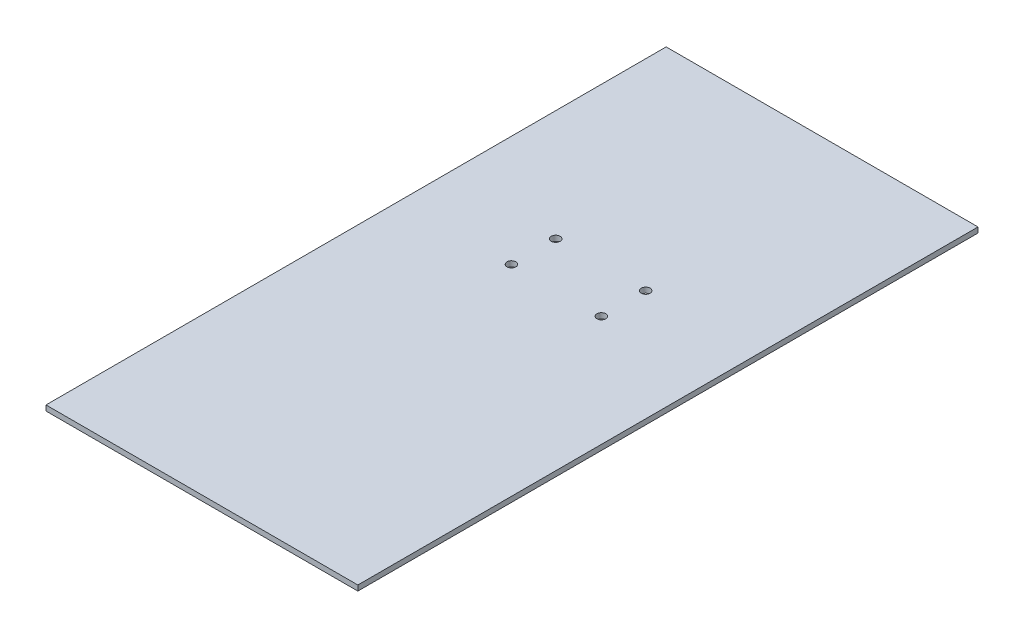
ISO-10303-21;
HEADER;
FILE_DESCRIPTION(('STEP AP214'),'2;1');
FILE_NAME('part.step','',(''),(''),'','','');
FILE_SCHEMA(('AUTOMOTIVE_DESIGN { 1 0 10303 214 1 1 1 1 }'));
ENDSEC;
DATA;
#1=APPLICATION_CONTEXT('core data for automotive mechanical design processes');
#2=APPLICATION_PROTOCOL_DEFINITION('international standard','automotive_design',2000,#1);
#3=PRODUCT_CONTEXT('',#1,'mechanical');
#4=PRODUCT('Part','Part','',(#3));
#5=PRODUCT_RELATED_PRODUCT_CATEGORY('part','',(#4));
#6=PRODUCT_DEFINITION_FORMATION('','',#4);
#7=PRODUCT_DEFINITION_CONTEXT('part definition',#1,'design');
#8=PRODUCT_DEFINITION('design','',#6,#7);
#9=PRODUCT_DEFINITION_SHAPE('','',#8);
#10=(LENGTH_UNIT() NAMED_UNIT(*) SI_UNIT(.MILLI.,.METRE.));
#11=(NAMED_UNIT(*) PLANE_ANGLE_UNIT() SI_UNIT($,.RADIAN.));
#12=(NAMED_UNIT(*) SI_UNIT($,.STERADIAN.) SOLID_ANGLE_UNIT());
#13=UNCERTAINTY_MEASURE_WITH_UNIT(LENGTH_MEASURE(1.E-05),#10,'distance_accuracy_value','');
#14=(GEOMETRIC_REPRESENTATION_CONTEXT(3) GLOBAL_UNCERTAINTY_ASSIGNED_CONTEXT((#13)) GLOBAL_UNIT_ASSIGNED_CONTEXT((#10,
#11,#12)) REPRESENTATION_CONTEXT('',''));
#15=CARTESIAN_POINT('',(0.,0.,0.));
#16=DIRECTION('',(0.,0.,1.));
#17=DIRECTION('',(1.,0.,0.));
#18=AXIS2_PLACEMENT_3D('',#15,#16,#17);
#19=CARTESIAN_POINT('',(0.,3.,0.));
#20=DIRECTION('',(1.,0.,0.));
#21=DIRECTION('',(0.,0.,-1.));
#22=AXIS2_PLACEMENT_3D('',#19,#20,#21);
#23=PLANE('',#22);
#24=DIRECTION('',(0.,0.,1.));
#25=VECTOR('',#24,1.);
#26=CARTESIAN_POINT('',(0.,0.,0.));
#27=LINE('',#26,#25);
#28=CARTESIAN_POINT('',(0.,0.,-350.));
#29=VERTEX_POINT('',#28);
#30=CARTESIAN_POINT('',(0.,0.,0.));
#31=VERTEX_POINT('',#30);
#32=EDGE_CURVE('E95',#29,#31,#27,.T.);
#33=ORIENTED_EDGE('',*,*,#32,.T.);
#34=DIRECTION('',(0.,-1.,0.));
#35=VECTOR('',#34,1.);
#36=CARTESIAN_POINT('',(0.,3.,0.));
#37=LINE('',#36,#35);
#38=CARTESIAN_POINT('',(0.,3.,0.));
#39=VERTEX_POINT('',#38);
#40=EDGE_CURVE('E11',#39,#31,#37,.T.);
#41=ORIENTED_EDGE('',*,*,#40,.F.);
#42=DIRECTION('',(0.,0.,1.));
#43=VECTOR('',#42,1.);
#44=CARTESIAN_POINT('',(0.,3.,0.));
#45=LINE('',#44,#43);
#46=CARTESIAN_POINT('',(0.,3.,-350.));
#47=VERTEX_POINT('',#46);
#48=EDGE_CURVE('E83',#47,#39,#45,.T.);
#49=ORIENTED_EDGE('',*,*,#48,.F.);
#50=DIRECTION('',(0.,-1.,0.));
#51=VECTOR('',#50,1.);
#52=CARTESIAN_POINT('',(0.,3.,-350.));
#53=LINE('',#52,#51);
#54=EDGE_CURVE('E91',#47,#29,#53,.T.);
#55=ORIENTED_EDGE('',*,*,#54,.T.);
#56=EDGE_LOOP('',(#33,#41,#49,#55));
#57=FACE_BOUND('',#56,.T.);
#58=ADVANCED_FACE('F32',(#57),#23,.F.);
#59=CARTESIAN_POINT('',(0.,3.,0.));
#60=DIRECTION('',(0.,0.,-1.));
#61=DIRECTION('',(-1.,0.,0.));
#62=AXIS2_PLACEMENT_3D('',#59,#60,#61);
#63=PLANE('',#62);
#64=DIRECTION('',(1.,0.,0.));
#65=VECTOR('',#64,1.);
#66=CARTESIAN_POINT('',(0.,0.,0.));
#67=LINE('',#66,#65);
#68=CARTESIAN_POINT('',(176.,0.,0.));
#69=VERTEX_POINT('',#68);
#70=EDGE_CURVE('E87',#31,#69,#67,.T.);
#71=ORIENTED_EDGE('',*,*,#70,.T.);
#72=DIRECTION('',(0.,-1.,0.));
#73=VECTOR('',#72,1.);
#74=CARTESIAN_POINT('',(176.,3.,0.));
#75=LINE('',#74,#73);
#76=CARTESIAN_POINT('',(176.,3.,0.));
#77=VERTEX_POINT('',#76);
#78=EDGE_CURVE('E40',#77,#69,#75,.T.);
#79=ORIENTED_EDGE('',*,*,#78,.F.);
#80=DIRECTION('',(1.,0.,0.));
#81=VECTOR('',#80,1.);
#82=CARTESIAN_POINT('',(0.,3.,0.));
#83=LINE('',#82,#81);
#84=EDGE_CURVE('E78',#39,#77,#83,.T.);
#85=ORIENTED_EDGE('',*,*,#84,.F.);
#86=ORIENTED_EDGE('',*,*,#40,.T.);
#87=EDGE_LOOP('',(#71,#79,#85,#86));
#88=FACE_BOUND('',#87,.T.);
#89=ADVANCED_FACE('F86',(#88),#63,.F.);
#90=CARTESIAN_POINT('',(176.,3.,0.));
#91=DIRECTION('',(-1.,0.,0.));
#92=DIRECTION('',(0.,0.,1.));
#93=AXIS2_PLACEMENT_3D('',#90,#91,#92);
#94=PLANE('',#93);
#95=DIRECTION('',(0.,0.,-1.));
#96=VECTOR('',#95,1.);
#97=CARTESIAN_POINT('',(176.,0.,0.));
#98=LINE('',#97,#96);
#99=CARTESIAN_POINT('',(176.,0.,-350.));
#100=VERTEX_POINT('',#99);
#101=EDGE_CURVE('E65',#69,#100,#98,.T.);
#102=ORIENTED_EDGE('',*,*,#101,.T.);
#103=DIRECTION('',(0.,-1.,0.));
#104=VECTOR('',#103,1.);
#105=CARTESIAN_POINT('',(176.,3.,-350.));
#106=LINE('',#105,#104);
#107=CARTESIAN_POINT('',(176.,3.,-350.));
#108=VERTEX_POINT('',#107);
#109=EDGE_CURVE('E88',#108,#100,#106,.T.);
#110=ORIENTED_EDGE('',*,*,#109,.F.);
#111=DIRECTION('',(0.,0.,-1.));
#112=VECTOR('',#111,1.);
#113=CARTESIAN_POINT('',(176.,3.,0.));
#114=LINE('',#113,#112);
#115=EDGE_CURVE('E81',#77,#108,#114,.T.);
#116=ORIENTED_EDGE('',*,*,#115,.F.);
#117=ORIENTED_EDGE('',*,*,#78,.T.);
#118=EDGE_LOOP('',(#102,#110,#116,#117));
#119=FACE_BOUND('',#118,.T.);
#120=ADVANCED_FACE('F89',(#119),#94,.F.);
#121=CARTESIAN_POINT('',(0.,3.,-350.));
#122=DIRECTION('',(0.,0.,1.));
#123=DIRECTION('',(1.,0.,0.));
#124=AXIS2_PLACEMENT_3D('',#121,#122,#123);
#125=PLANE('',#124);
#126=DIRECTION('',(-1.,0.,0.));
#127=VECTOR('',#126,1.);
#128=CARTESIAN_POINT('',(0.,0.,-350.));
#129=LINE('',#128,#127);
#130=EDGE_CURVE('E71',#100,#29,#129,.T.);
#131=ORIENTED_EDGE('',*,*,#130,.T.);
#132=ORIENTED_EDGE('',*,*,#54,.F.);
#133=DIRECTION('',(-1.,0.,0.));
#134=VECTOR('',#133,1.);
#135=CARTESIAN_POINT('',(0.,3.,-350.));
#136=LINE('',#135,#134);
#137=EDGE_CURVE('E48',#108,#47,#136,.T.);
#138=ORIENTED_EDGE('',*,*,#137,.F.);
#139=ORIENTED_EDGE('',*,*,#109,.T.);
#140=EDGE_LOOP('',(#131,#132,#138,#139));
#141=FACE_BOUND('',#140,.T.);
#142=ADVANCED_FACE('F103',(#141),#125,.F.);
#143=CARTESIAN_POINT('',(0.,3.,0.));
#144=DIRECTION('',(0.,-1.,0.));
#145=DIRECTION('',(0.,0.,-1.));
#146=AXIS2_PLACEMENT_3D('',#143,#144,#145);
#147=PLANE('',#146);
#148=CARTESIAN_POINT('',(113.399603526398,3.,-225.06));
#149=DIRECTION('',(0.,-1.,0.));
#150=DIRECTION('',(0.,0.,-1.));
#151=AXIS2_PLACEMENT_3D('',#148,#149,#150);
#152=CIRCLE('',#151,2.5);
#153=CARTESIAN_POINT('',(113.399603526398,3.,-227.56));
#154=VERTEX_POINT('',#153);
#155=EDGE_CURVE('E126',#154,#154,#152,.T.);
#156=ORIENTED_EDGE('',*,*,#155,.T.);
#157=EDGE_LOOP('',(#156));
#158=FACE_BOUND('',#157,.T.);
#159=CARTESIAN_POINT('',(113.399603526398,3.,-200.06));
#160=DIRECTION('',(0.,-1.,0.));
#161=DIRECTION('',(0.,0.,-1.));
#162=AXIS2_PLACEMENT_3D('',#159,#160,#161);
#163=CIRCLE('',#162,2.5);
#164=CARTESIAN_POINT('',(113.399603526398,3.,-202.56));
#165=VERTEX_POINT('',#164);
#166=EDGE_CURVE('E120',#165,#165,#163,.T.);
#167=ORIENTED_EDGE('',*,*,#166,.T.);
#168=EDGE_LOOP('',(#167));
#169=FACE_BOUND('',#168,.T.);
#170=CARTESIAN_POINT('',(62.6247079800215,3.,-225.06));
#171=DIRECTION('',(0.,-1.,0.));
#172=DIRECTION('',(0.,0.,-1.));
#173=AXIS2_PLACEMENT_3D('',#170,#171,#172);
#174=CIRCLE('',#173,2.5);
#175=CARTESIAN_POINT('',(62.6247079800215,3.,-227.56));
#176=VERTEX_POINT('',#175);
#177=EDGE_CURVE('E114',#176,#176,#174,.T.);
#178=ORIENTED_EDGE('',*,*,#177,.T.);
#179=EDGE_LOOP('',(#178));
#180=FACE_BOUND('',#179,.T.);
#181=CARTESIAN_POINT('',(62.6247079800215,3.,-200.06));
#182=DIRECTION('',(0.,-1.,0.));
#183=DIRECTION('',(0.,0.,-1.));
#184=AXIS2_PLACEMENT_3D('',#181,#182,#183);
#185=CIRCLE('',#184,2.5);
#186=CARTESIAN_POINT('',(62.6247079800215,3.,-202.56));
#187=VERTEX_POINT('',#186);
#188=EDGE_CURVE('E98',#187,#187,#185,.T.);
#189=ORIENTED_EDGE('',*,*,#188,.T.);
#190=EDGE_LOOP('',(#189));
#191=FACE_BOUND('',#190,.T.);
#192=ORIENTED_EDGE('',*,*,#48,.T.);
#193=ORIENTED_EDGE('',*,*,#84,.T.);
#194=ORIENTED_EDGE('',*,*,#115,.T.);
#195=ORIENTED_EDGE('',*,*,#137,.T.);
#196=EDGE_LOOP('',(#192,#193,#194,#195));
#197=FACE_BOUND('',#196,.T.);
#198=ADVANCED_FACE('F79',(#158,#169,#180,#191,#197),#147,.F.);
#199=CARTESIAN_POINT('',(0.,0.,0.));
#200=DIRECTION('',(0.,-1.,0.));
#201=DIRECTION('',(0.,0.,-1.));
#202=AXIS2_PLACEMENT_3D('',#199,#200,#201);
#203=PLANE('',#202);
#204=CARTESIAN_POINT('',(113.399603526398,0.,-225.06));
#205=DIRECTION('',(0.,-1.,0.));
#206=DIRECTION('',(0.,0.,-1.));
#207=AXIS2_PLACEMENT_3D('',#204,#205,#206);
#208=CIRCLE('',#207,2.49999999999999);
#209=CARTESIAN_POINT('',(113.399603526398,0.,-227.56));
#210=VERTEX_POINT('',#209);
#211=EDGE_CURVE('E129',#210,#210,#208,.T.);
#212=ORIENTED_EDGE('',*,*,#211,.F.);
#213=EDGE_LOOP('',(#212));
#214=FACE_BOUND('',#213,.T.);
#215=CARTESIAN_POINT('',(113.399603526398,0.,-200.06));
#216=DIRECTION('',(0.,-1.,0.));
#217=DIRECTION('',(0.,0.,-1.));
#218=AXIS2_PLACEMENT_3D('',#215,#216,#217);
#219=CIRCLE('',#218,2.49999999999999);
#220=CARTESIAN_POINT('',(113.399603526398,0.,-202.56));
#221=VERTEX_POINT('',#220);
#222=EDGE_CURVE('E123',#221,#221,#219,.T.);
#223=ORIENTED_EDGE('',*,*,#222,.F.);
#224=EDGE_LOOP('',(#223));
#225=FACE_BOUND('',#224,.T.);
#226=CARTESIAN_POINT('',(62.6247079800215,0.,-225.06));
#227=DIRECTION('',(0.,-1.,0.));
#228=DIRECTION('',(0.,0.,-1.));
#229=AXIS2_PLACEMENT_3D('',#226,#227,#228);
#230=CIRCLE('',#229,2.49999999999999);
#231=CARTESIAN_POINT('',(62.6247079800215,0.,-227.56));
#232=VERTEX_POINT('',#231);
#233=EDGE_CURVE('E117',#232,#232,#230,.T.);
#234=ORIENTED_EDGE('',*,*,#233,.F.);
#235=EDGE_LOOP('',(#234));
#236=FACE_BOUND('',#235,.T.);
#237=CARTESIAN_POINT('',(62.6247079800215,0.,-200.06));
#238=DIRECTION('',(0.,-1.,0.));
#239=DIRECTION('',(0.,0.,-1.));
#240=AXIS2_PLACEMENT_3D('',#237,#238,#239);
#241=CIRCLE('',#240,2.49999999999999);
#242=CARTESIAN_POINT('',(62.6247079800215,0.,-202.56));
#243=VERTEX_POINT('',#242);
#244=EDGE_CURVE('E111',#243,#243,#241,.T.);
#245=ORIENTED_EDGE('',*,*,#244,.F.);
#246=EDGE_LOOP('',(#245));
#247=FACE_BOUND('',#246,.T.);
#248=ORIENTED_EDGE('',*,*,#32,.F.);
#249=ORIENTED_EDGE('',*,*,#130,.F.);
#250=ORIENTED_EDGE('',*,*,#101,.F.);
#251=ORIENTED_EDGE('',*,*,#70,.F.);
#252=EDGE_LOOP('',(#248,#249,#250,#251));
#253=FACE_BOUND('',#252,.T.);
#254=ADVANCED_FACE('F106',(#214,#225,#236,#247,#253),#203,.T.);
#255=CARTESIAN_POINT('',(62.6247079800215,0.,-200.06));
#256=DIRECTION('',(0.,-1.,0.));
#257=DIRECTION('',(0.,0.,-1.));
#258=AXIS2_PLACEMENT_3D('',#255,#256,#257);
#259=CYLINDRICAL_SURFACE('',#258,2.5);
#260=ORIENTED_EDGE('',*,*,#188,.F.);
#261=EDGE_LOOP('',(#260));
#262=FACE_BOUND('',#261,.T.);
#263=ORIENTED_EDGE('',*,*,#244,.T.);
#264=EDGE_LOOP('',(#263));
#265=FACE_BOUND('',#264,.T.);
#266=ADVANCED_FACE('F137',(#262,#265),#259,.F.);
#267=CARTESIAN_POINT('',(62.6247079800215,0.,-225.06));
#268=DIRECTION('',(0.,-1.,0.));
#269=DIRECTION('',(0.,0.,-1.));
#270=AXIS2_PLACEMENT_3D('',#267,#268,#269);
#271=CYLINDRICAL_SURFACE('',#270,2.5);
#272=ORIENTED_EDGE('',*,*,#177,.F.);
#273=EDGE_LOOP('',(#272));
#274=FACE_BOUND('',#273,.T.);
#275=ORIENTED_EDGE('',*,*,#233,.T.);
#276=EDGE_LOOP('',(#275));
#277=FACE_BOUND('',#276,.T.);
#278=ADVANCED_FACE('F146',(#274,#277),#271,.F.);
#279=CARTESIAN_POINT('',(113.399603526398,0.,-200.06));
#280=DIRECTION('',(0.,-1.,0.));
#281=DIRECTION('',(0.,0.,-1.));
#282=AXIS2_PLACEMENT_3D('',#279,#280,#281);
#283=CYLINDRICAL_SURFACE('',#282,2.5);
#284=ORIENTED_EDGE('',*,*,#166,.F.);
#285=EDGE_LOOP('',(#284));
#286=FACE_BOUND('',#285,.T.);
#287=ORIENTED_EDGE('',*,*,#222,.T.);
#288=EDGE_LOOP('',(#287));
#289=FACE_BOUND('',#288,.T.);
#290=ADVANCED_FACE('F152',(#286,#289),#283,.F.);
#291=CARTESIAN_POINT('',(113.399603526398,0.,-225.06));
#292=DIRECTION('',(0.,-1.,0.));
#293=DIRECTION('',(0.,0.,-1.));
#294=AXIS2_PLACEMENT_3D('',#291,#292,#293);
#295=CYLINDRICAL_SURFACE('',#294,2.5);
#296=ORIENTED_EDGE('',*,*,#155,.F.);
#297=EDGE_LOOP('',(#296));
#298=FACE_BOUND('',#297,.T.);
#299=ORIENTED_EDGE('',*,*,#211,.T.);
#300=EDGE_LOOP('',(#299));
#301=FACE_BOUND('',#300,.T.);
#302=ADVANCED_FACE('F133',(#298,#301),#295,.F.);
#303=CLOSED_SHELL('',(#58,#89,#120,#142,#198,#254,#266,#278,#290,#302));
#304=MANIFOLD_SOLID_BREP('B2',#303);
#305=ADVANCED_BREP_SHAPE_REPRESENTATION('',(#18,#304),#14);
#306=SHAPE_DEFINITION_REPRESENTATION(#9,#305);
ENDSEC;
END-ISO-10303-21;
